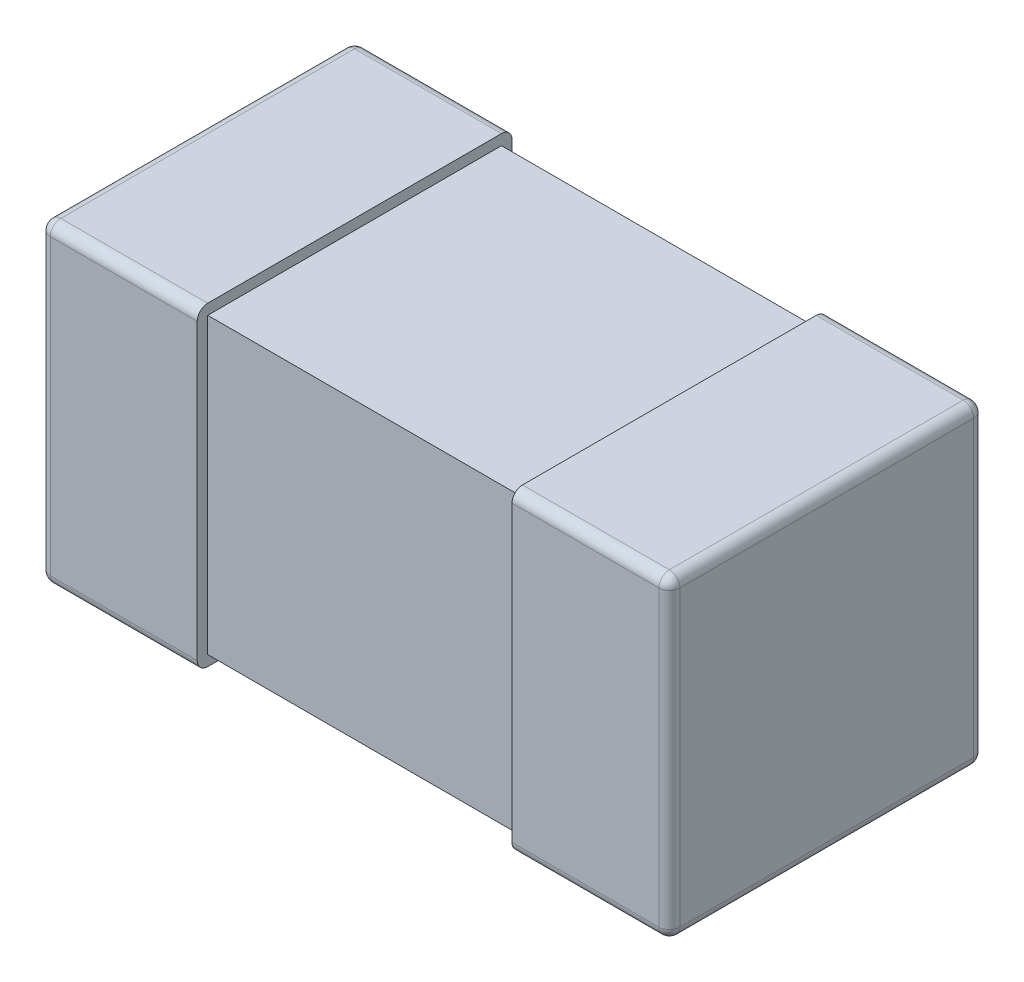
ISO-10303-21;
HEADER;
FILE_DESCRIPTION(('STEP AP214'),'2;1');
FILE_NAME('part.step','',(''),(''),'','','');
FILE_SCHEMA(('AUTOMOTIVE_DESIGN { 1 0 10303 214 1 1 1 1 }'));
ENDSEC;
DATA;
#1=APPLICATION_CONTEXT('core data for automotive mechanical design processes');
#2=APPLICATION_PROTOCOL_DEFINITION('international standard','automotive_design',2000,#1);
#3=PRODUCT_CONTEXT('',#1,'mechanical');
#4=PRODUCT('Part','Part','',(#3));
#5=PRODUCT_RELATED_PRODUCT_CATEGORY('part','',(#4));
#6=PRODUCT_DEFINITION_FORMATION('','',#4);
#7=PRODUCT_DEFINITION_CONTEXT('part definition',#1,'design');
#8=PRODUCT_DEFINITION('design','',#6,#7);
#9=PRODUCT_DEFINITION_SHAPE('','',#8);
#10=(LENGTH_UNIT() NAMED_UNIT(*) SI_UNIT(.MILLI.,.METRE.));
#11=(NAMED_UNIT(*) PLANE_ANGLE_UNIT() SI_UNIT($,.RADIAN.));
#12=(NAMED_UNIT(*) SI_UNIT($,.STERADIAN.) SOLID_ANGLE_UNIT());
#13=UNCERTAINTY_MEASURE_WITH_UNIT(LENGTH_MEASURE(1.E-05),#10,'distance_accuracy_value','');
#14=(GEOMETRIC_REPRESENTATION_CONTEXT(3) GLOBAL_UNCERTAINTY_ASSIGNED_CONTEXT((#13)) GLOBAL_UNIT_ASSIGNED_CONTEXT((#10,
#11,#12)) REPRESENTATION_CONTEXT('',''));
#15=CARTESIAN_POINT('',(0.,0.,0.));
#16=DIRECTION('',(0.,0.,1.));
#17=DIRECTION('',(1.,0.,0.));
#18=AXIS2_PLACEMENT_3D('',#15,#16,#17);
#19=CARTESIAN_POINT('',(-0.3,0.15,-0.15));
#20=DIRECTION('',(1.,0.,0.));
#21=DIRECTION('',(0.,0.,-1.));
#22=AXIS2_PLACEMENT_3D('',#19,#20,#21);
#23=PLANE('',#22);
#24=DIRECTION('',(0.,0.,1.));
#25=VECTOR('',#24,1.);
#26=CARTESIAN_POINT('',(-0.3,-0.14,-0.15));
#27=LINE('',#26,#25);
#28=CARTESIAN_POINT('',(-0.3,-0.14,0.14));
#29=VERTEX_POINT('',#28);
#30=CARTESIAN_POINT('',(-0.3,-0.14,-0.14));
#31=VERTEX_POINT('',#30);
#32=EDGE_CURVE('E419',#29,#31,#27,.F.);
#33=ORIENTED_EDGE('',*,*,#32,.F.);
#34=DIRECTION('',(0.,-1.,0.));
#35=VECTOR('',#34,1.);
#36=CARTESIAN_POINT('',(-0.3,0.15,0.14));
#37=LINE('',#36,#35);
#38=CARTESIAN_POINT('',(-0.3,0.14,0.14));
#39=VERTEX_POINT('',#38);
#40=EDGE_CURVE('E521',#39,#29,#37,.T.);
#41=ORIENTED_EDGE('',*,*,#40,.F.);
#42=DIRECTION('',(0.,0.,-1.));
#43=VECTOR('',#42,1.);
#44=CARTESIAN_POINT('',(-0.3,0.14,0.15));
#45=LINE('',#44,#43);
#46=CARTESIAN_POINT('',(-0.3,0.14,-0.14));
#47=VERTEX_POINT('',#46);
#48=EDGE_CURVE('E452',#47,#39,#45,.F.);
#49=ORIENTED_EDGE('',*,*,#48,.F.);
#50=DIRECTION('',(0.,-1.,0.));
#51=VECTOR('',#50,1.);
#52=CARTESIAN_POINT('',(-0.3,0.15,-0.14));
#53=LINE('',#52,#51);
#54=EDGE_CURVE('E512',#31,#47,#53,.F.);
#55=ORIENTED_EDGE('',*,*,#54,.F.);
#56=EDGE_LOOP('',(#33,#41,#49,#55));
#57=FACE_BOUND('',#56,.T.);
#58=ADVANCED_FACE('F17',(#57),#23,.F.);
#59=CARTESIAN_POINT('',(0.3,0.15,-0.15));
#60=DIRECTION('',(-1.,0.,0.));
#61=DIRECTION('',(0.,0.,1.));
#62=AXIS2_PLACEMENT_3D('',#59,#60,#61);
#63=PLANE('',#62);
#64=DIRECTION('',(0.,0.,-1.));
#65=VECTOR('',#64,1.);
#66=CARTESIAN_POINT('',(0.3,0.14,0.15));
#67=LINE('',#66,#65);
#68=CARTESIAN_POINT('',(0.3,0.14,0.14));
#69=VERTEX_POINT('',#68);
#70=CARTESIAN_POINT('',(0.3,0.14,-0.14));
#71=VERTEX_POINT('',#70);
#72=EDGE_CURVE('E369',#69,#71,#67,.T.);
#73=ORIENTED_EDGE('',*,*,#72,.F.);
#74=DIRECTION('',(0.,-1.,0.));
#75=VECTOR('',#74,1.);
#76=CARTESIAN_POINT('',(0.3,0.15,0.14));
#77=LINE('',#76,#75);
#78=CARTESIAN_POINT('',(0.3,-0.14,0.14));
#79=VERTEX_POINT('',#78);
#80=EDGE_CURVE('E493',#79,#69,#77,.F.);
#81=ORIENTED_EDGE('',*,*,#80,.F.);
#82=DIRECTION('',(0.,0.,1.));
#83=VECTOR('',#82,1.);
#84=CARTESIAN_POINT('',(0.3,-0.14,-0.15));
#85=LINE('',#84,#83);
#86=CARTESIAN_POINT('',(0.3,-0.14,-0.14));
#87=VERTEX_POINT('',#86);
#88=EDGE_CURVE('E309',#87,#79,#85,.T.);
#89=ORIENTED_EDGE('',*,*,#88,.F.);
#90=DIRECTION('',(0.,-1.,0.));
#91=VECTOR('',#90,1.);
#92=CARTESIAN_POINT('',(0.3,0.15,-0.14));
#93=LINE('',#92,#91);
#94=EDGE_CURVE('E502',#71,#87,#93,.T.);
#95=ORIENTED_EDGE('',*,*,#94,.F.);
#96=EDGE_LOOP('',(#73,#81,#89,#95));
#97=FACE_BOUND('',#96,.T.);
#98=ADVANCED_FACE('F482',(#97),#63,.F.);
#99=CARTESIAN_POINT('',(-0.29,-0.14,0.14));
#100=DIRECTION('',(1.,0.,0.));
#101=DIRECTION('',(0.,0.,-1.));
#102=AXIS2_PLACEMENT_3D('',#99,#100,#101);
#103=SPHERICAL_SURFACE('',#102,0.01);
#104=CARTESIAN_POINT('',(-0.29,-0.14,0.14));
#105=DIRECTION('',(0.,-1.,0.));
#106=DIRECTION('',(0.,0.,-1.));
#107=AXIS2_PLACEMENT_3D('',#104,#105,#106);
#108=CIRCLE('',#107,0.01);
#109=CARTESIAN_POINT('',(-0.29,-0.14,0.15));
#110=VERTEX_POINT('',#109);
#111=EDGE_CURVE('E524',#29,#110,#108,.F.);
#112=ORIENTED_EDGE('',*,*,#111,.F.);
#113=CARTESIAN_POINT('',(-0.29,-0.14,0.14));
#114=DIRECTION('',(0.,0.,1.));
#115=DIRECTION('',(1.,0.,0.));
#116=AXIS2_PLACEMENT_3D('',#113,#114,#115);
#117=CIRCLE('',#116,0.01);
#118=CARTESIAN_POINT('',(-0.29,-0.15,0.14));
#119=VERTEX_POINT('',#118);
#120=EDGE_CURVE('E406',#119,#29,#117,.F.);
#121=ORIENTED_EDGE('',*,*,#120,.F.);
#122=CARTESIAN_POINT('',(-0.29,-0.14,0.14));
#123=DIRECTION('',(1.,0.,0.));
#124=DIRECTION('',(0.,0.,-1.));
#125=AXIS2_PLACEMENT_3D('',#122,#123,#124);
#126=CIRCLE('',#125,0.01);
#127=EDGE_CURVE('E196',#110,#119,#126,.T.);
#128=ORIENTED_EDGE('',*,*,#127,.F.);
#129=EDGE_LOOP('',(#112,#121,#128));
#130=FACE_BOUND('',#129,.T.);
#131=ADVANCED_FACE('F478',(#130),#103,.T.);
#132=CARTESIAN_POINT('',(-0.29,0.15,0.14));
#133=DIRECTION('',(0.,-1.,0.));
#134=DIRECTION('',(0.,0.,-1.));
#135=AXIS2_PLACEMENT_3D('',#132,#133,#134);
#136=CYLINDRICAL_SURFACE('',#135,0.01);
#137=ORIENTED_EDGE('',*,*,#111,.T.);
#138=DIRECTION('',(0.,1.,0.));
#139=VECTOR('',#138,1.);
#140=CARTESIAN_POINT('',(-0.29,0.15,0.15));
#141=LINE('',#140,#139);
#142=CARTESIAN_POINT('',(-0.29,0.140000000000001,0.15));
#143=VERTEX_POINT('',#142);
#144=EDGE_CURVE('E195',#110,#143,#141,.T.);
#145=ORIENTED_EDGE('',*,*,#144,.T.);
#146=CARTESIAN_POINT('',(-0.29,0.14,0.14));
#147=DIRECTION('',(0.,-1.,3.35853907326562E-13));
#148=DIRECTION('',(1.,0.,0.));
#149=AXIS2_PLACEMENT_3D('',#146,#147,#148);
#150=CIRCLE('',#149,0.01);
#151=EDGE_CURVE('E462',#39,#143,#150,.F.);
#152=ORIENTED_EDGE('',*,*,#151,.F.);
#153=ORIENTED_EDGE('',*,*,#40,.T.);
#154=EDGE_LOOP('',(#137,#145,#152,#153));
#155=FACE_BOUND('',#154,.T.);
#156=ADVANCED_FACE('F474',(#155),#136,.T.);
#157=CARTESIAN_POINT('',(-0.29,0.14,0.14));
#158=DIRECTION('',(1.,0.,0.));
#159=DIRECTION('',(0.,0.,-1.));
#160=AXIS2_PLACEMENT_3D('',#157,#158,#159);
#161=SPHERICAL_SURFACE('',#160,0.01);
#162=CARTESIAN_POINT('',(-0.29,0.14,0.14));
#163=DIRECTION('',(0.,0.,-1.));
#164=DIRECTION('',(-1.,0.,0.));
#165=AXIS2_PLACEMENT_3D('',#162,#163,#164);
#166=CIRCLE('',#165,0.01);
#167=CARTESIAN_POINT('',(-0.29,0.15,0.14));
#168=VERTEX_POINT('',#167);
#169=EDGE_CURVE('E459',#39,#168,#166,.T.);
#170=ORIENTED_EDGE('',*,*,#169,.F.);
#171=ORIENTED_EDGE('',*,*,#151,.T.);
#172=CARTESIAN_POINT('',(-0.29,0.14,0.14));
#173=DIRECTION('',(-1.,0.,0.));
#174=DIRECTION('',(0.,0.,1.));
#175=AXIS2_PLACEMENT_3D('',#172,#173,#174);
#176=CIRCLE('',#175,0.01);
#177=EDGE_CURVE('E297',#168,#143,#176,.F.);
#178=ORIENTED_EDGE('',*,*,#177,.F.);
#179=EDGE_LOOP('',(#170,#171,#178));
#180=FACE_BOUND('',#179,.T.);
#181=ADVANCED_FACE('F471',(#180),#161,.T.);
#182=CARTESIAN_POINT('',(-0.29,0.14,0.15));
#183=DIRECTION('',(0.,0.,-1.));
#184=DIRECTION('',(-1.,0.,0.));
#185=AXIS2_PLACEMENT_3D('',#182,#183,#184);
#186=CYLINDRICAL_SURFACE('',#185,0.01);
#187=CARTESIAN_POINT('',(-0.29,0.14,-0.14));
#188=DIRECTION('',(0.,-3.3567021030669E-13,1.));
#189=DIRECTION('',(1.,0.,0.));
#190=AXIS2_PLACEMENT_3D('',#187,#188,#189);
#191=CIRCLE('',#190,0.01);
#192=CARTESIAN_POINT('',(-0.29,0.15,-0.139999999999999));
#193=VERTEX_POINT('',#192);
#194=EDGE_CURVE('E448',#47,#193,#191,.F.);
#195=ORIENTED_EDGE('',*,*,#194,.F.);
#196=ORIENTED_EDGE('',*,*,#48,.T.);
#197=ORIENTED_EDGE('',*,*,#169,.T.);
#198=DIRECTION('',(0.,0.,1.));
#199=VECTOR('',#198,1.);
#200=CARTESIAN_POINT('',(-0.29,0.15,0.15));
#201=LINE('',#200,#199);
#202=EDGE_CURVE('E292',#193,#168,#201,.T.);
#203=ORIENTED_EDGE('',*,*,#202,.F.);
#204=EDGE_LOOP('',(#195,#196,#197,#203));
#205=FACE_BOUND('',#204,.T.);
#206=ADVANCED_FACE('F440',(#205),#186,.T.);
#207=CARTESIAN_POINT('',(-0.29,0.14,-0.14));
#208=DIRECTION('',(1.,0.,0.));
#209=DIRECTION('',(0.,0.,-1.));
#210=AXIS2_PLACEMENT_3D('',#207,#208,#209);
#211=SPHERICAL_SURFACE('',#210,0.01);
#212=CARTESIAN_POINT('',(-0.29,0.14,-0.14));
#213=DIRECTION('',(1.,0.,0.));
#214=DIRECTION('',(0.,0.,-1.));
#215=AXIS2_PLACEMENT_3D('',#212,#213,#214);
#216=CIRCLE('',#215,0.01);
#217=CARTESIAN_POINT('',(-0.29,0.14,-0.15));
#218=VERTEX_POINT('',#217);
#219=EDGE_CURVE('E286',#218,#193,#216,.T.);
#220=ORIENTED_EDGE('',*,*,#219,.F.);
#221=CARTESIAN_POINT('',(-0.29,0.14,-0.14));
#222=DIRECTION('',(0.,-1.,0.));
#223=DIRECTION('',(0.,0.,-1.));
#224=AXIS2_PLACEMENT_3D('',#221,#222,#223);
#225=CIRCLE('',#224,0.01);
#226=EDGE_CURVE('E451',#47,#218,#225,.T.);
#227=ORIENTED_EDGE('',*,*,#226,.F.);
#228=ORIENTED_EDGE('',*,*,#194,.T.);
#229=EDGE_LOOP('',(#220,#227,#228));
#230=FACE_BOUND('',#229,.T.);
#231=ADVANCED_FACE('F435',(#230),#211,.T.);
#232=CARTESIAN_POINT('',(-0.29,0.15,-0.14));
#233=DIRECTION('',(0.,-1.,0.));
#234=DIRECTION('',(0.,0.,-1.));
#235=AXIS2_PLACEMENT_3D('',#232,#233,#234);
#236=CYLINDRICAL_SURFACE('',#235,0.01);
#237=CARTESIAN_POINT('',(-0.29,-0.14,-0.14));
#238=DIRECTION('',(0.,1.,0.));
#239=DIRECTION('',(1.,0.,0.));
#240=AXIS2_PLACEMENT_3D('',#237,#238,#239);
#241=CIRCLE('',#240,0.01);
#242=CARTESIAN_POINT('',(-0.29,-0.14,-0.15));
#243=VERTEX_POINT('',#242);
#244=EDGE_CURVE('E407',#31,#243,#241,.F.);
#245=ORIENTED_EDGE('',*,*,#244,.F.);
#246=ORIENTED_EDGE('',*,*,#54,.T.);
#247=ORIENTED_EDGE('',*,*,#226,.T.);
#248=DIRECTION('',(0.,1.,0.));
#249=VECTOR('',#248,1.);
#250=CARTESIAN_POINT('',(-0.29,0.15,-0.15));
#251=LINE('',#250,#249);
#252=EDGE_CURVE('E280',#218,#243,#251,.F.);
#253=ORIENTED_EDGE('',*,*,#252,.T.);
#254=EDGE_LOOP('',(#245,#246,#247,#253));
#255=FACE_BOUND('',#254,.T.);
#256=ADVANCED_FACE('F431',(#255),#236,.T.);
#257=CARTESIAN_POINT('',(-0.29,-0.14,-0.14));
#258=DIRECTION('',(1.,0.,0.));
#259=DIRECTION('',(0.,0.,-1.));
#260=AXIS2_PLACEMENT_3D('',#257,#258,#259);
#261=SPHERICAL_SURFACE('',#260,0.01);
#262=CARTESIAN_POINT('',(-0.29,-0.14,-0.14));
#263=DIRECTION('',(-1.,0.,0.));
#264=DIRECTION('',(0.,0.,1.));
#265=AXIS2_PLACEMENT_3D('',#262,#263,#264);
#266=CIRCLE('',#265,0.01);
#267=CARTESIAN_POINT('',(-0.29,-0.15,-0.14));
#268=VERTEX_POINT('',#267);
#269=EDGE_CURVE('E274',#268,#243,#266,.F.);
#270=ORIENTED_EDGE('',*,*,#269,.F.);
#271=CARTESIAN_POINT('',(-0.29,-0.14,-0.14));
#272=DIRECTION('',(0.,0.,1.));
#273=DIRECTION('',(1.,0.,0.));
#274=AXIS2_PLACEMENT_3D('',#271,#272,#273);
#275=CIRCLE('',#274,0.01);
#276=EDGE_CURVE('E403',#31,#268,#275,.T.);
#277=ORIENTED_EDGE('',*,*,#276,.F.);
#278=ORIENTED_EDGE('',*,*,#244,.T.);
#279=EDGE_LOOP('',(#270,#277,#278));
#280=FACE_BOUND('',#279,.T.);
#281=ADVANCED_FACE('F428',(#280),#261,.T.);
#282=CARTESIAN_POINT('',(-0.29,-0.14,-0.15));
#283=DIRECTION('',(0.,0.,1.));
#284=DIRECTION('',(1.,0.,0.));
#285=AXIS2_PLACEMENT_3D('',#282,#283,#284);
#286=CYLINDRICAL_SURFACE('',#285,0.01);
#287=ORIENTED_EDGE('',*,*,#120,.T.);
#288=ORIENTED_EDGE('',*,*,#32,.T.);
#289=ORIENTED_EDGE('',*,*,#276,.T.);
#290=DIRECTION('',(0.,0.,1.));
#291=VECTOR('',#290,1.);
#292=CARTESIAN_POINT('',(-0.29,-0.15,0.15));
#293=LINE('',#292,#291);
#294=EDGE_CURVE('E265',#268,#119,#293,.T.);
#295=ORIENTED_EDGE('',*,*,#294,.T.);
#296=EDGE_LOOP('',(#287,#288,#289,#295));
#297=FACE_BOUND('',#296,.T.);
#298=ADVANCED_FACE('F391',(#297),#286,.T.);
#299=CARTESIAN_POINT('',(0.29,-0.14,-0.14));
#300=DIRECTION('',(-1.,0.,0.));
#301=DIRECTION('',(0.,0.,-1.));
#302=AXIS2_PLACEMENT_3D('',#299,#300,#301);
#303=SPHERICAL_SURFACE('',#302,0.01);
#304=CARTESIAN_POINT('',(0.29,-0.14,-0.14));
#305=DIRECTION('',(0.,0.,1.));
#306=DIRECTION('',(1.,0.,0.));
#307=AXIS2_PLACEMENT_3D('',#304,#305,#306);
#308=CIRCLE('',#307,0.01);
#309=CARTESIAN_POINT('',(0.29,-0.15,-0.14));
#310=VERTEX_POINT('',#309);
#311=EDGE_CURVE('E320',#310,#87,#308,.T.);
#312=ORIENTED_EDGE('',*,*,#311,.F.);
#313=CARTESIAN_POINT('',(0.29,-0.14,-0.14));
#314=DIRECTION('',(1.,0.,0.));
#315=DIRECTION('',(0.,0.,-1.));
#316=AXIS2_PLACEMENT_3D('',#313,#314,#315);
#317=CIRCLE('',#316,0.01);
#318=CARTESIAN_POINT('',(0.29,-0.14,-0.15));
#319=VERTEX_POINT('',#318);
#320=EDGE_CURVE('E259',#319,#310,#317,.F.);
#321=ORIENTED_EDGE('',*,*,#320,.F.);
#322=CARTESIAN_POINT('',(0.29,-0.14,-0.14));
#323=DIRECTION('',(0.,-1.,0.));
#324=DIRECTION('',(0.,0.,-1.));
#325=AXIS2_PLACEMENT_3D('',#322,#323,#324);
#326=CIRCLE('',#325,0.01);
#327=EDGE_CURVE('E505',#87,#319,#326,.F.);
#328=ORIENTED_EDGE('',*,*,#327,.F.);
#329=EDGE_LOOP('',(#312,#321,#328));
#330=FACE_BOUND('',#329,.T.);
#331=ADVANCED_FACE('F386',(#330),#303,.T.);
#332=CARTESIAN_POINT('',(0.29,0.15,-0.14));
#333=DIRECTION('',(0.,-1.,0.));
#334=DIRECTION('',(0.,0.,-1.));
#335=AXIS2_PLACEMENT_3D('',#332,#333,#334);
#336=CYLINDRICAL_SURFACE('',#335,0.01);
#337=ORIENTED_EDGE('',*,*,#327,.T.);
#338=DIRECTION('',(0.,1.,0.));
#339=VECTOR('',#338,1.);
#340=CARTESIAN_POINT('',(0.29,0.15,-0.15));
#341=LINE('',#340,#339);
#342=CARTESIAN_POINT('',(0.29,0.14,-0.15));
#343=VERTEX_POINT('',#342);
#344=EDGE_CURVE('E258',#319,#343,#341,.T.);
#345=ORIENTED_EDGE('',*,*,#344,.T.);
#346=CARTESIAN_POINT('',(0.29,0.14,-0.14));
#347=DIRECTION('',(0.,-1.,0.));
#348=DIRECTION('',(-1.,0.,0.));
#349=AXIS2_PLACEMENT_3D('',#346,#347,#348);
#350=CIRCLE('',#349,0.01);
#351=EDGE_CURVE('E377',#71,#343,#350,.F.);
#352=ORIENTED_EDGE('',*,*,#351,.F.);
#353=ORIENTED_EDGE('',*,*,#94,.T.);
#354=EDGE_LOOP('',(#337,#345,#352,#353));
#355=FACE_BOUND('',#354,.T.);
#356=ADVANCED_FACE('F382',(#355),#336,.T.);
#357=CARTESIAN_POINT('',(0.29,0.14,-0.14));
#358=DIRECTION('',(-1.,0.,0.));
#359=DIRECTION('',(0.,0.,-1.));
#360=AXIS2_PLACEMENT_3D('',#357,#358,#359);
#361=SPHERICAL_SURFACE('',#360,0.01);
#362=ORIENTED_EDGE('',*,*,#351,.T.);
#363=CARTESIAN_POINT('',(0.29,0.14,-0.14));
#364=DIRECTION('',(-1.,0.,0.));
#365=DIRECTION('',(0.,0.,1.));
#366=AXIS2_PLACEMENT_3D('',#363,#364,#365);
#367=CIRCLE('',#366,0.01);
#368=CARTESIAN_POINT('',(0.29,0.15,-0.14));
#369=VERTEX_POINT('',#368);
#370=EDGE_CURVE('E252',#369,#343,#367,.T.);
#371=ORIENTED_EDGE('',*,*,#370,.F.);
#372=CARTESIAN_POINT('',(0.29,0.14,-0.14));
#373=DIRECTION('',(0.,0.,-1.));
#374=DIRECTION('',(-1.,0.,0.));
#375=AXIS2_PLACEMENT_3D('',#372,#373,#374);
#376=CIRCLE('',#375,0.01);
#377=EDGE_CURVE('E360',#71,#369,#376,.F.);
#378=ORIENTED_EDGE('',*,*,#377,.F.);
#379=EDGE_LOOP('',(#362,#371,#378));
#380=FACE_BOUND('',#379,.T.);
#381=ADVANCED_FACE('F379',(#380),#361,.T.);
#382=CARTESIAN_POINT('',(0.29,0.14,0.15));
#383=DIRECTION('',(0.,0.,-1.));
#384=DIRECTION('',(-1.,0.,0.));
#385=AXIS2_PLACEMENT_3D('',#382,#383,#384);
#386=CYLINDRICAL_SURFACE('',#385,0.01);
#387=ORIENTED_EDGE('',*,*,#377,.T.);
#388=DIRECTION('',(0.,0.,1.));
#389=VECTOR('',#388,1.);
#390=CARTESIAN_POINT('',(0.29,0.15,0.15));
#391=LINE('',#390,#389);
#392=CARTESIAN_POINT('',(0.29,0.15,0.140000000000001));
#393=VERTEX_POINT('',#392);
#394=EDGE_CURVE('E246',#393,#369,#391,.F.);
#395=ORIENTED_EDGE('',*,*,#394,.F.);
#396=CARTESIAN_POINT('',(0.29,0.14,0.14));
#397=DIRECTION('',(0.,3.35915139666519E-13,-1.));
#398=DIRECTION('',(-1.,0.,0.));
#399=AXIS2_PLACEMENT_3D('',#396,#397,#398);
#400=CIRCLE('',#399,0.01);
#401=EDGE_CURVE('E356',#69,#393,#400,.F.);
#402=ORIENTED_EDGE('',*,*,#401,.F.);
#403=ORIENTED_EDGE('',*,*,#72,.T.);
#404=EDGE_LOOP('',(#387,#395,#402,#403));
#405=FACE_BOUND('',#404,.T.);
#406=ADVANCED_FACE('F348',(#405),#386,.T.);
#407=CARTESIAN_POINT('',(0.29,0.14,0.14));
#408=DIRECTION('',(-1.,0.,0.));
#409=DIRECTION('',(0.,0.,-1.));
#410=AXIS2_PLACEMENT_3D('',#407,#408,#409);
#411=SPHERICAL_SURFACE('',#410,0.01);
#412=CARTESIAN_POINT('',(0.29,0.14,0.14));
#413=DIRECTION('',(0.,-1.,0.));
#414=DIRECTION('',(0.,0.,-1.));
#415=AXIS2_PLACEMENT_3D('',#412,#413,#414);
#416=CIRCLE('',#415,0.01);
#417=CARTESIAN_POINT('',(0.29,0.14,0.15));
#418=VERTEX_POINT('',#417);
#419=EDGE_CURVE('E359',#69,#418,#416,.T.);
#420=ORIENTED_EDGE('',*,*,#419,.F.);
#421=ORIENTED_EDGE('',*,*,#401,.T.);
#422=CARTESIAN_POINT('',(0.29,0.14,0.14));
#423=DIRECTION('',(1.,0.,0.));
#424=DIRECTION('',(0.,0.,-1.));
#425=AXIS2_PLACEMENT_3D('',#422,#423,#424);
#426=CIRCLE('',#425,0.01);
#427=EDGE_CURVE('E240',#418,#393,#426,.F.);
#428=ORIENTED_EDGE('',*,*,#427,.F.);
#429=EDGE_LOOP('',(#420,#421,#428));
#430=FACE_BOUND('',#429,.T.);
#431=ADVANCED_FACE('F343',(#430),#411,.T.);
#432=CARTESIAN_POINT('',(0.29,0.15,0.14));
#433=DIRECTION('',(0.,-1.,0.));
#434=DIRECTION('',(0.,0.,-1.));
#435=AXIS2_PLACEMENT_3D('',#432,#433,#434);
#436=CYLINDRICAL_SURFACE('',#435,0.01);
#437=CARTESIAN_POINT('',(0.29,-0.14,0.14));
#438=DIRECTION('',(0.,1.,0.));
#439=DIRECTION('',(-1.,0.,0.));
#440=AXIS2_PLACEMENT_3D('',#437,#438,#439);
#441=CIRCLE('',#440,0.01);
#442=CARTESIAN_POINT('',(0.29,-0.14,0.15));
#443=VERTEX_POINT('',#442);
#444=EDGE_CURVE('E323',#79,#443,#441,.F.);
#445=ORIENTED_EDGE('',*,*,#444,.F.);
#446=ORIENTED_EDGE('',*,*,#80,.T.);
#447=ORIENTED_EDGE('',*,*,#419,.T.);
#448=DIRECTION('',(0.,1.,0.));
#449=VECTOR('',#448,1.);
#450=CARTESIAN_POINT('',(0.29,0.15,0.15));
#451=LINE('',#450,#449);
#452=EDGE_CURVE('E234',#418,#443,#451,.F.);
#453=ORIENTED_EDGE('',*,*,#452,.T.);
#454=EDGE_LOOP('',(#445,#446,#447,#453));
#455=FACE_BOUND('',#454,.T.);
#456=ADVANCED_FACE('F338',(#455),#436,.T.);
#457=CARTESIAN_POINT('',(0.29,-0.14,0.14));
#458=DIRECTION('',(-1.,0.,0.));
#459=DIRECTION('',(0.,0.,-1.));
#460=AXIS2_PLACEMENT_3D('',#457,#458,#459);
#461=SPHERICAL_SURFACE('',#460,0.01);
#462=CARTESIAN_POINT('',(0.29,-0.14,0.14));
#463=DIRECTION('',(0.,0.,1.));
#464=DIRECTION('',(1.,0.,0.));
#465=AXIS2_PLACEMENT_3D('',#462,#463,#464);
#466=CIRCLE('',#465,0.01);
#467=CARTESIAN_POINT('',(0.29,-0.15,0.14));
#468=VERTEX_POINT('',#467);
#469=EDGE_CURVE('E306',#79,#468,#466,.F.);
#470=ORIENTED_EDGE('',*,*,#469,.F.);
#471=ORIENTED_EDGE('',*,*,#444,.T.);
#472=CARTESIAN_POINT('',(0.29,-0.14,0.14));
#473=DIRECTION('',(-1.,0.,0.));
#474=DIRECTION('',(0.,0.,1.));
#475=AXIS2_PLACEMENT_3D('',#472,#473,#474);
#476=CIRCLE('',#475,0.01);
#477=EDGE_CURVE('E228',#468,#443,#476,.T.);
#478=ORIENTED_EDGE('',*,*,#477,.F.);
#479=EDGE_LOOP('',(#470,#471,#478));
#480=FACE_BOUND('',#479,.T.);
#481=ADVANCED_FACE('F333',(#480),#461,.T.);
#482=CARTESIAN_POINT('',(0.29,-0.14,-0.15));
#483=DIRECTION('',(0.,0.,1.));
#484=DIRECTION('',(1.,0.,0.));
#485=AXIS2_PLACEMENT_3D('',#482,#483,#484);
#486=CYLINDRICAL_SURFACE('',#485,0.01);
#487=ORIENTED_EDGE('',*,*,#469,.T.);
#488=DIRECTION('',(0.,0.,1.));
#489=VECTOR('',#488,1.);
#490=CARTESIAN_POINT('',(0.29,-0.15,0.15));
#491=LINE('',#490,#489);
#492=EDGE_CURVE('E215',#468,#310,#491,.F.);
#493=ORIENTED_EDGE('',*,*,#492,.T.);
#494=ORIENTED_EDGE('',*,*,#311,.T.);
#495=ORIENTED_EDGE('',*,*,#88,.T.);
#496=EDGE_LOOP('',(#487,#493,#494,#495));
#497=FACE_BOUND('',#496,.T.);
#498=ADVANCED_FACE('F337',(#497),#486,.T.);
#499=CARTESIAN_POINT('',(-0.3,-0.14,0.14));
#500=DIRECTION('',(1.,0.,0.));
#501=DIRECTION('',(0.,0.,-1.));
#502=AXIS2_PLACEMENT_3D('',#499,#500,#501);
#503=CYLINDRICAL_SURFACE('',#502,0.01);
#504=ORIENTED_EDGE('',*,*,#127,.T.);
#505=DIRECTION('',(1.,0.,0.));
#506=VECTOR('',#505,1.);
#507=CARTESIAN_POINT('',(-0.3,-0.15,0.14));
#508=LINE('',#507,#506);
#509=CARTESIAN_POINT('',(-0.15,-0.15,0.14));
#510=VERTEX_POINT('',#509);
#511=EDGE_CURVE('E177',#119,#510,#508,.T.);
#512=ORIENTED_EDGE('',*,*,#511,.T.);
#513=CARTESIAN_POINT('',(-0.15,-0.14,0.14));
#514=DIRECTION('',(1.,0.,0.));
#515=DIRECTION('',(0.,0.,-1.));
#516=AXIS2_PLACEMENT_3D('',#513,#514,#515);
#517=CIRCLE('',#516,0.01);
#518=CARTESIAN_POINT('',(-0.15,-0.14,0.15));
#519=VERTEX_POINT('',#518);
#520=EDGE_CURVE('E20',#510,#519,#517,.F.);
#521=ORIENTED_EDGE('',*,*,#520,.T.);
#522=DIRECTION('',(-1.,0.,0.));
#523=VECTOR('',#522,1.);
#524=CARTESIAN_POINT('',(-0.3,-0.14,0.15));
#525=LINE('',#524,#523);
#526=EDGE_CURVE('E183',#519,#110,#525,.T.);
#527=ORIENTED_EDGE('',*,*,#526,.T.);
#528=EDGE_LOOP('',(#504,#512,#521,#527));
#529=FACE_BOUND('',#528,.T.);
#530=ADVANCED_FACE('F182',(#529),#503,.T.);
#531=CARTESIAN_POINT('',(-0.3,0.15,0.15));
#532=DIRECTION('',(0.,0.,-1.));
#533=DIRECTION('',(-1.,0.,0.));
#534=AXIS2_PLACEMENT_3D('',#531,#532,#533);
#535=PLANE('',#534);
#536=ORIENTED_EDGE('',*,*,#526,.F.);
#537=DIRECTION('',(0.,1.,0.));
#538=VECTOR('',#537,1.);
#539=CARTESIAN_POINT('',(-0.15,0.15,0.15));
#540=LINE('',#539,#538);
#541=CARTESIAN_POINT('',(-0.15,0.14,0.15));
#542=VERTEX_POINT('',#541);
#543=EDGE_CURVE('E188',#519,#542,#540,.T.);
#544=ORIENTED_EDGE('',*,*,#543,.T.);
#545=DIRECTION('',(-1.,0.,0.));
#546=VECTOR('',#545,1.);
#547=CARTESIAN_POINT('',(-0.3,0.14,0.15));
#548=LINE('',#547,#546);
#549=EDGE_CURVE('E295',#143,#542,#548,.F.);
#550=ORIENTED_EDGE('',*,*,#549,.F.);
#551=ORIENTED_EDGE('',*,*,#144,.F.);
#552=EDGE_LOOP('',(#536,#544,#550,#551));
#553=FACE_BOUND('',#552,.T.);
#554=ADVANCED_FACE('F192',(#553),#535,.F.);
#555=CARTESIAN_POINT('',(-0.3,0.14,0.14));
#556=DIRECTION('',(-1.,0.,0.));
#557=DIRECTION('',(0.,0.,1.));
#558=AXIS2_PLACEMENT_3D('',#555,#556,#557);
#559=CYLINDRICAL_SURFACE('',#558,0.01);
#560=ORIENTED_EDGE('',*,*,#177,.T.);
#561=ORIENTED_EDGE('',*,*,#549,.T.);
#562=CARTESIAN_POINT('',(-0.15,0.14,0.14));
#563=DIRECTION('',(-1.,0.,0.));
#564=DIRECTION('',(0.,0.,1.));
#565=AXIS2_PLACEMENT_3D('',#562,#563,#564);
#566=CIRCLE('',#565,0.01);
#567=CARTESIAN_POINT('',(-0.15,0.15,0.14));
#568=VERTEX_POINT('',#567);
#569=EDGE_CURVE('E203',#542,#568,#566,.T.);
#570=ORIENTED_EDGE('',*,*,#569,.T.);
#571=DIRECTION('',(1.,0.,0.));
#572=VECTOR('',#571,1.);
#573=CARTESIAN_POINT('',(-0.3,0.15,0.14));
#574=LINE('',#573,#572);
#575=EDGE_CURVE('E289',#168,#568,#574,.T.);
#576=ORIENTED_EDGE('',*,*,#575,.F.);
#577=EDGE_LOOP('',(#560,#561,#570,#576));
#578=FACE_BOUND('',#577,.T.);
#579=ADVANCED_FACE('F580',(#578),#559,.T.);
#580=CARTESIAN_POINT('',(-0.3,0.15,0.15));
#581=DIRECTION('',(0.,1.,0.));
#582=DIRECTION('',(0.,0.,1.));
#583=AXIS2_PLACEMENT_3D('',#580,#581,#582);
#584=PLANE('',#583);
#585=ORIENTED_EDGE('',*,*,#202,.T.);
#586=ORIENTED_EDGE('',*,*,#575,.T.);
#587=DIRECTION('',(0.,0.,1.));
#588=VECTOR('',#587,1.);
#589=CARTESIAN_POINT('',(-0.15,0.15,-0.15));
#590=LINE('',#589,#588);
#591=CARTESIAN_POINT('',(-0.15,0.15,-0.14));
#592=VERTEX_POINT('',#591);
#593=EDGE_CURVE('E205',#568,#592,#590,.F.);
#594=ORIENTED_EDGE('',*,*,#593,.T.);
#595=DIRECTION('',(1.,0.,0.));
#596=VECTOR('',#595,1.);
#597=CARTESIAN_POINT('',(-0.3,0.15,-0.14));
#598=LINE('',#597,#596);
#599=EDGE_CURVE('E281',#193,#592,#598,.T.);
#600=ORIENTED_EDGE('',*,*,#599,.F.);
#601=EDGE_LOOP('',(#585,#586,#594,#600));
#602=FACE_BOUND('',#601,.T.);
#603=ADVANCED_FACE('F551',(#602),#584,.T.);
#604=CARTESIAN_POINT('',(-0.3,0.14,-0.14));
#605=DIRECTION('',(1.,0.,0.));
#606=DIRECTION('',(0.,0.,-1.));
#607=AXIS2_PLACEMENT_3D('',#604,#605,#606);
#608=CYLINDRICAL_SURFACE('',#607,0.01);
#609=ORIENTED_EDGE('',*,*,#219,.T.);
#610=ORIENTED_EDGE('',*,*,#599,.T.);
#611=CARTESIAN_POINT('',(-0.15,0.14,-0.14));
#612=DIRECTION('',(1.,0.,0.));
#613=DIRECTION('',(0.,0.,-1.));
#614=AXIS2_PLACEMENT_3D('',#611,#612,#613);
#615=CIRCLE('',#614,0.01);
#616=CARTESIAN_POINT('',(-0.15,0.14,-0.15));
#617=VERTEX_POINT('',#616);
#618=EDGE_CURVE('E544',#592,#617,#615,.F.);
#619=ORIENTED_EDGE('',*,*,#618,.T.);
#620=DIRECTION('',(1.,0.,0.));
#621=VECTOR('',#620,1.);
#622=CARTESIAN_POINT('',(-0.3,0.14,-0.15));
#623=LINE('',#622,#621);
#624=EDGE_CURVE('E277',#617,#218,#623,.F.);
#625=ORIENTED_EDGE('',*,*,#624,.T.);
#626=EDGE_LOOP('',(#609,#610,#619,#625));
#627=FACE_BOUND('',#626,.T.);
#628=ADVANCED_FACE('F554',(#627),#608,.T.);
#629=CARTESIAN_POINT('',(-0.3,0.15,-0.15));
#630=DIRECTION('',(0.,0.,1.));
#631=DIRECTION('',(1.,0.,0.));
#632=AXIS2_PLACEMENT_3D('',#629,#630,#631);
#633=PLANE('',#632);
#634=DIRECTION('',(-1.,0.,0.));
#635=VECTOR('',#634,1.);
#636=CARTESIAN_POINT('',(-0.3,-0.14,-0.15));
#637=LINE('',#636,#635);
#638=CARTESIAN_POINT('',(-0.15,-0.14,-0.15));
#639=VERTEX_POINT('',#638);
#640=EDGE_CURVE('E269',#243,#639,#637,.F.);
#641=ORIENTED_EDGE('',*,*,#640,.F.);
#642=ORIENTED_EDGE('',*,*,#252,.F.);
#643=ORIENTED_EDGE('',*,*,#624,.F.);
#644=DIRECTION('',(0.,1.,0.));
#645=VECTOR('',#644,1.);
#646=CARTESIAN_POINT('',(-0.15,0.15,-0.15));
#647=LINE('',#646,#645);
#648=EDGE_CURVE('E543',#617,#639,#647,.F.);
#649=ORIENTED_EDGE('',*,*,#648,.T.);
#650=EDGE_LOOP('',(#641,#642,#643,#649));
#651=FACE_BOUND('',#650,.T.);
#652=ADVANCED_FACE('F558',(#651),#633,.F.);
#653=CARTESIAN_POINT('',(-0.3,-0.14,-0.14));
#654=DIRECTION('',(-1.,0.,0.));
#655=DIRECTION('',(0.,0.,1.));
#656=AXIS2_PLACEMENT_3D('',#653,#654,#655);
#657=CYLINDRICAL_SURFACE('',#656,0.01);
#658=ORIENTED_EDGE('',*,*,#269,.T.);
#659=ORIENTED_EDGE('',*,*,#640,.T.);
#660=CARTESIAN_POINT('',(-0.15,-0.14,-0.14));
#661=DIRECTION('',(-1.,0.,0.));
#662=DIRECTION('',(0.,0.,1.));
#663=AXIS2_PLACEMENT_3D('',#660,#661,#662);
#664=CIRCLE('',#663,0.01);
#665=CARTESIAN_POINT('',(-0.15,-0.15,-0.14));
#666=VERTEX_POINT('',#665);
#667=EDGE_CURVE('E540',#639,#666,#664,.T.);
#668=ORIENTED_EDGE('',*,*,#667,.T.);
#669=DIRECTION('',(1.,0.,0.));
#670=VECTOR('',#669,1.);
#671=CARTESIAN_POINT('',(-0.3,-0.15,-0.14));
#672=LINE('',#671,#670);
#673=EDGE_CURVE('E262',#666,#268,#672,.F.);
#674=ORIENTED_EDGE('',*,*,#673,.T.);
#675=EDGE_LOOP('',(#658,#659,#668,#674));
#676=FACE_BOUND('',#675,.T.);
#677=ADVANCED_FACE('F561',(#676),#657,.T.);
#678=CARTESIAN_POINT('',(-0.3,-0.15,0.15));
#679=DIRECTION('',(0.,1.,0.));
#680=DIRECTION('',(0.,0.,1.));
#681=AXIS2_PLACEMENT_3D('',#678,#679,#680);
#682=PLANE('',#681);
#683=ORIENTED_EDGE('',*,*,#673,.F.);
#684=DIRECTION('',(0.,0.,1.));
#685=VECTOR('',#684,1.);
#686=CARTESIAN_POINT('',(-0.15,-0.15,-0.15));
#687=LINE('',#686,#685);
#688=EDGE_CURVE('E542',#666,#510,#687,.T.);
#689=ORIENTED_EDGE('',*,*,#688,.T.);
#690=ORIENTED_EDGE('',*,*,#511,.F.);
#691=ORIENTED_EDGE('',*,*,#294,.F.);
#692=EDGE_LOOP('',(#683,#689,#690,#691));
#693=FACE_BOUND('',#692,.T.);
#694=ADVANCED_FACE('F649',(#693),#682,.F.);
#695=CARTESIAN_POINT('',(-0.545979797464467,-0.14,0.14));
#696=DIRECTION('',(0.,-1.,0.));
#697=DIRECTION('',(0.,0.,-1.));
#698=AXIS2_PLACEMENT_3D('',#695,#696,#697);
#699=PLANE('',#698);
#700=DIRECTION('',(-1.,0.,0.));
#701=VECTOR('',#700,1.);
#702=CARTESIAN_POINT('',(-0.545979797464467,-0.14,-0.14));
#703=LINE('',#702,#701);
#704=CARTESIAN_POINT('',(0.15,-0.14,-0.14));
#705=VERTEX_POINT('',#704);
#706=CARTESIAN_POINT('',(-0.15,-0.14,-0.14));
#707=VERTEX_POINT('',#706);
#708=EDGE_CURVE('E212',#705,#707,#703,.T.);
#709=ORIENTED_EDGE('',*,*,#708,.F.);
#710=DIRECTION('',(0.,0.,-1.));
#711=VECTOR('',#710,1.);
#712=CARTESIAN_POINT('',(0.15,-0.14,-0.15));
#713=LINE('',#712,#711);
#714=CARTESIAN_POINT('',(0.15,-0.14,0.14));
#715=VERTEX_POINT('',#714);
#716=EDGE_CURVE('E719',#705,#715,#713,.F.);
#717=ORIENTED_EDGE('',*,*,#716,.T.);
#718=DIRECTION('',(1.,0.,0.));
#719=VECTOR('',#718,1.);
#720=CARTESIAN_POINT('',(-0.545979797464467,-0.14,0.14));
#721=LINE('',#720,#719);
#722=CARTESIAN_POINT('',(-0.15,-0.14,0.14));
#723=VERTEX_POINT('',#722);
#724=EDGE_CURVE('E721',#723,#715,#721,.T.);
#725=ORIENTED_EDGE('',*,*,#724,.F.);
#726=DIRECTION('',(0.,0.,1.));
#727=VECTOR('',#726,1.);
#728=CARTESIAN_POINT('',(-0.15,-0.14,-0.15));
#729=LINE('',#728,#727);
#730=EDGE_CURVE('E210',#723,#707,#729,.F.);
#731=ORIENTED_EDGE('',*,*,#730,.T.);
#732=EDGE_LOOP('',(#709,#717,#725,#731));
#733=FACE_BOUND('',#732,.T.);
#734=ADVANCED_FACE('F645',(#733),#699,.T.);
#735=CARTESIAN_POINT('',(0.3,-0.14,-0.14));
#736=DIRECTION('',(1.,0.,0.));
#737=DIRECTION('',(0.,0.,-1.));
#738=AXIS2_PLACEMENT_3D('',#735,#736,#737);
#739=CYLINDRICAL_SURFACE('',#738,0.01);
#740=ORIENTED_EDGE('',*,*,#320,.T.);
#741=DIRECTION('',(1.,0.,0.));
#742=VECTOR('',#741,1.);
#743=CARTESIAN_POINT('',(0.3,-0.15,-0.14));
#744=LINE('',#743,#742);
#745=CARTESIAN_POINT('',(0.15,-0.15,-0.14));
#746=VERTEX_POINT('',#745);
#747=EDGE_CURVE('E219',#310,#746,#744,.F.);
#748=ORIENTED_EDGE('',*,*,#747,.T.);
#749=CARTESIAN_POINT('',(0.15,-0.14,-0.14));
#750=DIRECTION('',(1.,0.,0.));
#751=DIRECTION('',(0.,0.,-1.));
#752=AXIS2_PLACEMENT_3D('',#749,#750,#751);
#753=CIRCLE('',#752,0.01);
#754=CARTESIAN_POINT('',(0.15,-0.14,-0.15));
#755=VERTEX_POINT('',#754);
#756=EDGE_CURVE('E537',#746,#755,#753,.T.);
#757=ORIENTED_EDGE('',*,*,#756,.T.);
#758=DIRECTION('',(1.,0.,0.));
#759=VECTOR('',#758,1.);
#760=CARTESIAN_POINT('',(0.3,-0.14,-0.15));
#761=LINE('',#760,#759);
#762=EDGE_CURVE('E255',#755,#319,#761,.T.);
#763=ORIENTED_EDGE('',*,*,#762,.T.);
#764=EDGE_LOOP('',(#740,#748,#757,#763));
#765=FACE_BOUND('',#764,.T.);
#766=ADVANCED_FACE('F641',(#765),#739,.T.);
#767=CARTESIAN_POINT('',(0.3,0.15,-0.15));
#768=DIRECTION('',(0.,0.,1.));
#769=DIRECTION('',(1.,0.,0.));
#770=AXIS2_PLACEMENT_3D('',#767,#768,#769);
#771=PLANE('',#770);
#772=DIRECTION('',(-1.,0.,0.));
#773=VECTOR('',#772,1.);
#774=CARTESIAN_POINT('',(0.3,0.14,-0.15));
#775=LINE('',#774,#773);
#776=CARTESIAN_POINT('',(0.15,0.14,-0.15));
#777=VERTEX_POINT('',#776);
#778=EDGE_CURVE('E249',#343,#777,#775,.T.);
#779=ORIENTED_EDGE('',*,*,#778,.F.);
#780=ORIENTED_EDGE('',*,*,#344,.F.);
#781=ORIENTED_EDGE('',*,*,#762,.F.);
#782=DIRECTION('',(0.,1.,0.));
#783=VECTOR('',#782,1.);
#784=CARTESIAN_POINT('',(0.15,0.15,-0.15));
#785=LINE('',#784,#783);
#786=EDGE_CURVE('E536',#755,#777,#785,.T.);
#787=ORIENTED_EDGE('',*,*,#786,.T.);
#788=EDGE_LOOP('',(#779,#780,#781,#787));
#789=FACE_BOUND('',#788,.T.);
#790=ADVANCED_FACE('F637',(#789),#771,.F.);
#791=CARTESIAN_POINT('',(0.3,0.14,-0.14));
#792=DIRECTION('',(-1.,0.,0.));
#793=DIRECTION('',(0.,0.,1.));
#794=AXIS2_PLACEMENT_3D('',#791,#792,#793);
#795=CYLINDRICAL_SURFACE('',#794,0.01);
#796=ORIENTED_EDGE('',*,*,#370,.T.);
#797=ORIENTED_EDGE('',*,*,#778,.T.);
#798=CARTESIAN_POINT('',(0.15,0.14,-0.14));
#799=DIRECTION('',(-1.,0.,0.));
#800=DIRECTION('',(0.,0.,1.));
#801=AXIS2_PLACEMENT_3D('',#798,#799,#800);
#802=CIRCLE('',#801,0.01);
#803=CARTESIAN_POINT('',(0.15,0.15,-0.14));
#804=VERTEX_POINT('',#803);
#805=EDGE_CURVE('E534',#777,#804,#802,.F.);
#806=ORIENTED_EDGE('',*,*,#805,.T.);
#807=DIRECTION('',(1.,0.,0.));
#808=VECTOR('',#807,1.);
#809=CARTESIAN_POINT('',(0.3,0.15,-0.14));
#810=LINE('',#809,#808);
#811=EDGE_CURVE('E243',#369,#804,#810,.F.);
#812=ORIENTED_EDGE('',*,*,#811,.F.);
#813=EDGE_LOOP('',(#796,#797,#806,#812));
#814=FACE_BOUND('',#813,.T.);
#815=ADVANCED_FACE('F633',(#814),#795,.T.);
#816=CARTESIAN_POINT('',(0.3,0.15,0.15));
#817=DIRECTION('',(0.,1.,0.));
#818=DIRECTION('',(0.,0.,1.));
#819=AXIS2_PLACEMENT_3D('',#816,#817,#818);
#820=PLANE('',#819);
#821=ORIENTED_EDGE('',*,*,#394,.T.);
#822=ORIENTED_EDGE('',*,*,#811,.T.);
#823=DIRECTION('',(0.,0.,-1.));
#824=VECTOR('',#823,1.);
#825=CARTESIAN_POINT('',(0.15,0.15,-0.15));
#826=LINE('',#825,#824);
#827=CARTESIAN_POINT('',(0.15,0.15,0.14));
#828=VERTEX_POINT('',#827);
#829=EDGE_CURVE('E533',#804,#828,#826,.F.);
#830=ORIENTED_EDGE('',*,*,#829,.T.);
#831=DIRECTION('',(1.,0.,0.));
#832=VECTOR('',#831,1.);
#833=CARTESIAN_POINT('',(0.3,0.15,0.14));
#834=LINE('',#833,#832);
#835=EDGE_CURVE('E235',#393,#828,#834,.F.);
#836=ORIENTED_EDGE('',*,*,#835,.F.);
#837=EDGE_LOOP('',(#821,#822,#830,#836));
#838=FACE_BOUND('',#837,.T.);
#839=ADVANCED_FACE('F629',(#838),#820,.T.);
#840=CARTESIAN_POINT('',(0.3,0.14,0.14));
#841=DIRECTION('',(1.,0.,0.));
#842=DIRECTION('',(0.,0.,-1.));
#843=AXIS2_PLACEMENT_3D('',#840,#841,#842);
#844=CYLINDRICAL_SURFACE('',#843,0.01);
#845=ORIENTED_EDGE('',*,*,#427,.T.);
#846=ORIENTED_EDGE('',*,*,#835,.T.);
#847=CARTESIAN_POINT('',(0.15,0.14,0.14));
#848=DIRECTION('',(1.,0.,0.));
#849=DIRECTION('',(0.,0.,-1.));
#850=AXIS2_PLACEMENT_3D('',#847,#848,#849);
#851=CIRCLE('',#850,0.01);
#852=CARTESIAN_POINT('',(0.15,0.14,0.15));
#853=VERTEX_POINT('',#852);
#854=EDGE_CURVE('E531',#828,#853,#851,.T.);
#855=ORIENTED_EDGE('',*,*,#854,.T.);
#856=DIRECTION('',(-1.,0.,0.));
#857=VECTOR('',#856,1.);
#858=CARTESIAN_POINT('',(0.3,0.14,0.15));
#859=LINE('',#858,#857);
#860=EDGE_CURVE('E231',#853,#418,#859,.F.);
#861=ORIENTED_EDGE('',*,*,#860,.T.);
#862=EDGE_LOOP('',(#845,#846,#855,#861));
#863=FACE_BOUND('',#862,.T.);
#864=ADVANCED_FACE('F625',(#863),#844,.T.);
#865=CARTESIAN_POINT('',(0.3,0.15,0.15));
#866=DIRECTION('',(0.,0.,-1.));
#867=DIRECTION('',(-1.,0.,0.));
#868=AXIS2_PLACEMENT_3D('',#865,#866,#867);
#869=PLANE('',#868);
#870=ORIENTED_EDGE('',*,*,#860,.F.);
#871=DIRECTION('',(0.,1.,0.));
#872=VECTOR('',#871,1.);
#873=CARTESIAN_POINT('',(0.15,0.15,0.15));
#874=LINE('',#873,#872);
#875=CARTESIAN_POINT('',(0.15,-0.14,0.15));
#876=VERTEX_POINT('',#875);
#877=EDGE_CURVE('E530',#853,#876,#874,.F.);
#878=ORIENTED_EDGE('',*,*,#877,.T.);
#879=DIRECTION('',(-1.,0.,0.));
#880=VECTOR('',#879,1.);
#881=CARTESIAN_POINT('',(0.3,-0.14,0.15));
#882=LINE('',#881,#880);
#883=EDGE_CURVE('E223',#443,#876,#882,.T.);
#884=ORIENTED_EDGE('',*,*,#883,.F.);
#885=ORIENTED_EDGE('',*,*,#452,.F.);
#886=EDGE_LOOP('',(#870,#878,#884,#885));
#887=FACE_BOUND('',#886,.T.);
#888=ADVANCED_FACE('F621',(#887),#869,.F.);
#889=CARTESIAN_POINT('',(0.3,-0.14,0.14));
#890=DIRECTION('',(-1.,0.,0.));
#891=DIRECTION('',(0.,0.,1.));
#892=AXIS2_PLACEMENT_3D('',#889,#890,#891);
#893=CYLINDRICAL_SURFACE('',#892,0.01);
#894=ORIENTED_EDGE('',*,*,#477,.T.);
#895=ORIENTED_EDGE('',*,*,#883,.T.);
#896=CARTESIAN_POINT('',(0.15,-0.14,0.14));
#897=DIRECTION('',(-1.,0.,0.));
#898=DIRECTION('',(0.,0.,1.));
#899=AXIS2_PLACEMENT_3D('',#896,#897,#898);
#900=CIRCLE('',#899,0.01);
#901=CARTESIAN_POINT('',(0.15,-0.15,0.14));
#902=VERTEX_POINT('',#901);
#903=EDGE_CURVE('E527',#876,#902,#900,.F.);
#904=ORIENTED_EDGE('',*,*,#903,.T.);
#905=DIRECTION('',(1.,0.,0.));
#906=VECTOR('',#905,1.);
#907=CARTESIAN_POINT('',(0.3,-0.15,0.14));
#908=LINE('',#907,#906);
#909=EDGE_CURVE('E216',#902,#468,#908,.T.);
#910=ORIENTED_EDGE('',*,*,#909,.T.);
#911=EDGE_LOOP('',(#894,#895,#904,#910));
#912=FACE_BOUND('',#911,.T.);
#913=ADVANCED_FACE('F617',(#912),#893,.T.);
#914=CARTESIAN_POINT('',(0.3,-0.15,0.15));
#915=DIRECTION('',(0.,1.,0.));
#916=DIRECTION('',(0.,0.,1.));
#917=AXIS2_PLACEMENT_3D('',#914,#915,#916);
#918=PLANE('',#917);
#919=ORIENTED_EDGE('',*,*,#909,.F.);
#920=DIRECTION('',(0.,0.,-1.));
#921=VECTOR('',#920,1.);
#922=CARTESIAN_POINT('',(0.15,-0.15,-0.15));
#923=LINE('',#922,#921);
#924=EDGE_CURVE('E529',#902,#746,#923,.T.);
#925=ORIENTED_EDGE('',*,*,#924,.T.);
#926=ORIENTED_EDGE('',*,*,#747,.F.);
#927=ORIENTED_EDGE('',*,*,#492,.F.);
#928=EDGE_LOOP('',(#919,#925,#926,#927));
#929=FACE_BOUND('',#928,.T.);
#930=ADVANCED_FACE('F613',(#929),#918,.F.);
#931=CARTESIAN_POINT('',(-0.545979797464467,0.14,-0.14));
#932=DIRECTION('',(0.,0.,-1.));
#933=DIRECTION('',(-1.,0.,0.));
#934=AXIS2_PLACEMENT_3D('',#931,#932,#933);
#935=PLANE('',#934);
#936=DIRECTION('',(1.,0.,0.));
#937=VECTOR('',#936,1.);
#938=CARTESIAN_POINT('',(-0.545979797464467,0.14,-0.14));
#939=LINE('',#938,#937);
#940=CARTESIAN_POINT('',(0.15,0.14,-0.14));
#941=VERTEX_POINT('',#940);
#942=CARTESIAN_POINT('',(-0.15,0.14,-0.14));
#943=VERTEX_POINT('',#942);
#944=EDGE_CURVE('E706',#941,#943,#939,.F.);
#945=ORIENTED_EDGE('',*,*,#944,.F.);
#946=DIRECTION('',(0.,1.,0.));
#947=VECTOR('',#946,1.);
#948=CARTESIAN_POINT('',(0.15,0.15,-0.14));
#949=LINE('',#948,#947);
#950=EDGE_CURVE('E539',#941,#705,#949,.F.);
#951=ORIENTED_EDGE('',*,*,#950,.T.);
#952=ORIENTED_EDGE('',*,*,#708,.T.);
#953=DIRECTION('',(0.,1.,0.));
#954=VECTOR('',#953,1.);
#955=CARTESIAN_POINT('',(-0.15,0.15,-0.14));
#956=LINE('',#955,#954);
#957=EDGE_CURVE('E189',#707,#943,#956,.T.);
#958=ORIENTED_EDGE('',*,*,#957,.T.);
#959=EDGE_LOOP('',(#945,#951,#952,#958));
#960=FACE_BOUND('',#959,.T.);
#961=ADVANCED_FACE('F610',(#960),#935,.T.);
#962=CARTESIAN_POINT('',(-0.15,0.15,-0.15));
#963=DIRECTION('',(-1.,0.,0.));
#964=DIRECTION('',(0.,0.,1.));
#965=AXIS2_PLACEMENT_3D('',#962,#963,#964);
#966=PLANE('',#965);
#967=ORIENTED_EDGE('',*,*,#667,.F.);
#968=ORIENTED_EDGE('',*,*,#648,.F.);
#969=ORIENTED_EDGE('',*,*,#618,.F.);
#970=ORIENTED_EDGE('',*,*,#593,.F.);
#971=ORIENTED_EDGE('',*,*,#569,.F.);
#972=ORIENTED_EDGE('',*,*,#543,.F.);
#973=ORIENTED_EDGE('',*,*,#520,.F.);
#974=ORIENTED_EDGE('',*,*,#688,.F.);
#975=EDGE_LOOP('',(#967,#968,#969,#970,#971,#972,#973,#974));
#976=FACE_BOUND('',#975,.T.);
#977=ORIENTED_EDGE('',*,*,#730,.F.);
#978=DIRECTION('',(0.,1.,0.));
#979=VECTOR('',#978,1.);
#980=CARTESIAN_POINT('',(-0.15,0.14,0.14));
#981=LINE('',#980,#979);
#982=CARTESIAN_POINT('',(-0.15,0.14,0.14));
#983=VERTEX_POINT('',#982);
#984=EDGE_CURVE('E723',#983,#723,#981,.F.);
#985=ORIENTED_EDGE('',*,*,#984,.F.);
#986=DIRECTION('',(0.,0.,1.));
#987=VECTOR('',#986,1.);
#988=CARTESIAN_POINT('',(-0.15,0.14,0.14));
#989=LINE('',#988,#987);
#990=EDGE_CURVE('E709',#943,#983,#989,.T.);
#991=ORIENTED_EDGE('',*,*,#990,.F.);
#992=ORIENTED_EDGE('',*,*,#957,.F.);
#993=EDGE_LOOP('',(#977,#985,#991,#992));
#994=FACE_BOUND('',#993,.T.);
#995=ADVANCED_FACE('F200',(#976,#994),#966,.F.);
#996=CARTESIAN_POINT('',(-0.545979797464467,0.14,0.14));
#997=DIRECTION('',(0.,0.,1.));
#998=DIRECTION('',(1.,0.,0.));
#999=AXIS2_PLACEMENT_3D('',#996,#997,#998);
#1000=PLANE('',#999);
#1001=ORIENTED_EDGE('',*,*,#724,.T.);
#1002=DIRECTION('',(0.,1.,0.));
#1003=VECTOR('',#1002,1.);
#1004=CARTESIAN_POINT('',(0.15,0.15,0.14));
#1005=LINE('',#1004,#1003);
#1006=CARTESIAN_POINT('',(0.15,0.14,0.14));
#1007=VERTEX_POINT('',#1006);
#1008=EDGE_CURVE('E35',#715,#1007,#1005,.T.);
#1009=ORIENTED_EDGE('',*,*,#1008,.T.);
#1010=DIRECTION('',(1.,0.,0.));
#1011=VECTOR('',#1010,1.);
#1012=CARTESIAN_POINT('',(-0.545979797464467,0.14,0.14));
#1013=LINE('',#1012,#1011);
#1014=EDGE_CURVE('E26',#983,#1007,#1013,.T.);
#1015=ORIENTED_EDGE('',*,*,#1014,.F.);
#1016=ORIENTED_EDGE('',*,*,#984,.T.);
#1017=EDGE_LOOP('',(#1001,#1009,#1015,#1016));
#1018=FACE_BOUND('',#1017,.T.);
#1019=ADVANCED_FACE('F601',(#1018),#1000,.T.);
#1020=CARTESIAN_POINT('',(0.15,0.15,-0.15));
#1021=DIRECTION('',(1.,0.,0.));
#1022=DIRECTION('',(0.,0.,-1.));
#1023=AXIS2_PLACEMENT_3D('',#1020,#1021,#1022);
#1024=PLANE('',#1023);
#1025=ORIENTED_EDGE('',*,*,#903,.F.);
#1026=ORIENTED_EDGE('',*,*,#877,.F.);
#1027=ORIENTED_EDGE('',*,*,#854,.F.);
#1028=ORIENTED_EDGE('',*,*,#829,.F.);
#1029=ORIENTED_EDGE('',*,*,#805,.F.);
#1030=ORIENTED_EDGE('',*,*,#786,.F.);
#1031=ORIENTED_EDGE('',*,*,#756,.F.);
#1032=ORIENTED_EDGE('',*,*,#924,.F.);
#1033=EDGE_LOOP('',(#1025,#1026,#1027,#1028,#1029,#1030,#1031,#1032));
#1034=FACE_BOUND('',#1033,.T.);
#1035=DIRECTION('',(0.,0.,1.));
#1036=VECTOR('',#1035,1.);
#1037=CARTESIAN_POINT('',(0.15,0.14,0.14));
#1038=LINE('',#1037,#1036);
#1039=EDGE_CURVE('E11',#1007,#941,#1038,.F.);
#1040=ORIENTED_EDGE('',*,*,#1039,.F.);
#1041=ORIENTED_EDGE('',*,*,#1008,.F.);
#1042=ORIENTED_EDGE('',*,*,#716,.F.);
#1043=ORIENTED_EDGE('',*,*,#950,.F.);
#1044=EDGE_LOOP('',(#1040,#1041,#1042,#1043));
#1045=FACE_BOUND('',#1044,.T.);
#1046=ADVANCED_FACE('F595',(#1034,#1045),#1024,.F.);
#1047=CARTESIAN_POINT('',(-0.545979797464467,0.14,0.14));
#1048=DIRECTION('',(0.,1.,0.));
#1049=DIRECTION('',(0.,0.,1.));
#1050=AXIS2_PLACEMENT_3D('',#1047,#1048,#1049);
#1051=PLANE('',#1050);
#1052=ORIENTED_EDGE('',*,*,#1014,.T.);
#1053=ORIENTED_EDGE('',*,*,#1039,.T.);
#1054=ORIENTED_EDGE('',*,*,#944,.T.);
#1055=ORIENTED_EDGE('',*,*,#990,.T.);
#1056=EDGE_LOOP('',(#1052,#1053,#1054,#1055));
#1057=FACE_BOUND('',#1056,.T.);
#1058=ADVANCED_FACE('F593',(#1057),#1051,.T.);
#1059=CLOSED_SHELL('',(#58,#98,#131,#156,#181,#206,#231,#256,#281,#298,#331,#356,#381,#406,#431,
#456,#481,#498,#530,#554,#579,#603,#628,#652,#677,#694,#734,#766,#790,#815,#839,#864,#888,#913,
#930,#961,#995,#1019,#1046,#1058));
#1060=MANIFOLD_SOLID_BREP('B1',#1059);
#1061=ADVANCED_BREP_SHAPE_REPRESENTATION('',(#18,#1060),#14);
#1062=SHAPE_DEFINITION_REPRESENTATION(#9,#1061);
ENDSEC;
END-ISO-10303-21;
